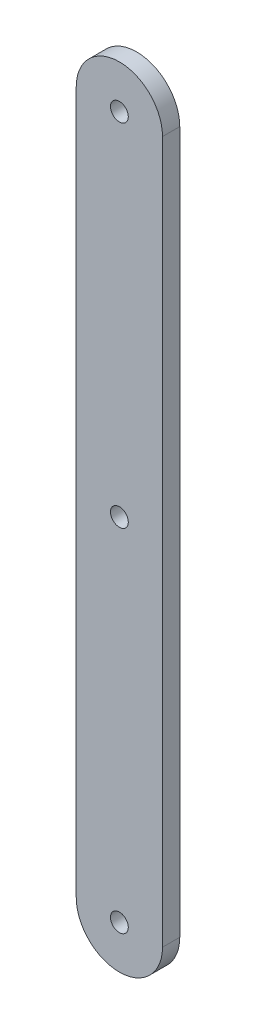
ISO-10303-21;
HEADER;
FILE_DESCRIPTION(('STEP AP214'),'2;1');
FILE_NAME('part.step','',(''),(''),'','','');
FILE_SCHEMA(('AUTOMOTIVE_DESIGN { 1 0 10303 214 1 1 1 1 }'));
ENDSEC;
DATA;
#1=APPLICATION_CONTEXT('core data for automotive mechanical design processes');
#2=APPLICATION_PROTOCOL_DEFINITION('international standard','automotive_design',2000,#1);
#3=PRODUCT_CONTEXT('',#1,'mechanical');
#4=PRODUCT('Part','Part','',(#3));
#5=PRODUCT_RELATED_PRODUCT_CATEGORY('part','',(#4));
#6=PRODUCT_DEFINITION_FORMATION('','',#4);
#7=PRODUCT_DEFINITION_CONTEXT('part definition',#1,'design');
#8=PRODUCT_DEFINITION('design','',#6,#7);
#9=PRODUCT_DEFINITION_SHAPE('','',#8);
#10=(LENGTH_UNIT() NAMED_UNIT(*) SI_UNIT(.MILLI.,.METRE.));
#11=(NAMED_UNIT(*) PLANE_ANGLE_UNIT() SI_UNIT($,.RADIAN.));
#12=(NAMED_UNIT(*) SI_UNIT($,.STERADIAN.) SOLID_ANGLE_UNIT());
#13=UNCERTAINTY_MEASURE_WITH_UNIT(LENGTH_MEASURE(1.E-05),#10,'distance_accuracy_value','');
#14=(GEOMETRIC_REPRESENTATION_CONTEXT(3) GLOBAL_UNCERTAINTY_ASSIGNED_CONTEXT((#13)) GLOBAL_UNIT_ASSIGNED_CONTEXT((#10,
#11,#12)) REPRESENTATION_CONTEXT('',''));
#15=CARTESIAN_POINT('',(0.,0.,0.));
#16=DIRECTION('',(0.,0.,1.));
#17=DIRECTION('',(1.,0.,0.));
#18=AXIS2_PLACEMENT_3D('',#15,#16,#17);
#19=CARTESIAN_POINT('',(0.,0.,3.));
#20=DIRECTION('',(0.,0.,1.));
#21=DIRECTION('',(1.,0.,0.));
#22=AXIS2_PLACEMENT_3D('',#19,#20,#21);
#23=PLANE('',#22);
#24=CARTESIAN_POINT('',(0.,122.06,3.));
#25=DIRECTION('',(0.,0.,1.));
#26=DIRECTION('',(1.,0.,0.));
#27=AXIS2_PLACEMENT_3D('',#24,#25,#26);
#28=CIRCLE('',#27,1.55);
#29=CARTESIAN_POINT('',(1.54999999999998,122.06,3.));
#30=VERTEX_POINT('',#29);
#31=EDGE_CURVE('E114',#30,#30,#28,.T.);
#32=ORIENTED_EDGE('',*,*,#31,.F.);
#33=EDGE_LOOP('',(#32));
#34=FACE_BOUND('',#33,.T.);
#35=CARTESIAN_POINT('',(0.,0.,3.));
#36=DIRECTION('',(0.,0.,1.));
#37=DIRECTION('',(1.,0.,0.));
#38=AXIS2_PLACEMENT_3D('',#35,#36,#37);
#39=CIRCLE('',#38,7.5);
#40=CARTESIAN_POINT('',(-7.5,0.,3.));
#41=VERTEX_POINT('',#40);
#42=CARTESIAN_POINT('',(7.5,0.,3.));
#43=VERTEX_POINT('',#42);
#44=EDGE_CURVE('E84',#41,#43,#39,.T.);
#45=ORIENTED_EDGE('',*,*,#44,.T.);
#46=DIRECTION('',(0.,1.,0.));
#47=VECTOR('',#46,1.);
#48=CARTESIAN_POINT('',(7.5,0.,3.));
#49=LINE('',#48,#47);
#50=CARTESIAN_POINT('',(7.49999999999998,122.06,3.));
#51=VERTEX_POINT('',#50);
#52=EDGE_CURVE('E79',#43,#51,#49,.T.);
#53=ORIENTED_EDGE('',*,*,#52,.T.);
#54=CARTESIAN_POINT('',(0.,122.06,3.));
#55=DIRECTION('',(0.,0.,1.));
#56=DIRECTION('',(1.,0.,0.));
#57=AXIS2_PLACEMENT_3D('',#54,#55,#56);
#58=CIRCLE('',#57,7.5);
#59=CARTESIAN_POINT('',(-7.50000000000002,122.06,3.));
#60=VERTEX_POINT('',#59);
#61=EDGE_CURVE('E82',#51,#60,#58,.T.);
#62=ORIENTED_EDGE('',*,*,#61,.T.);
#63=DIRECTION('',(0.,-1.,0.));
#64=VECTOR('',#63,1.);
#65=CARTESIAN_POINT('',(-7.5,0.,3.));
#66=LINE('',#65,#64);
#67=EDGE_CURVE('E49',#60,#41,#66,.T.);
#68=ORIENTED_EDGE('',*,*,#67,.T.);
#69=EDGE_LOOP('',(#45,#53,#62,#68));
#70=FACE_BOUND('',#69,.T.);
#71=CARTESIAN_POINT('',(0.,0.,3.));
#72=DIRECTION('',(0.,0.,1.));
#73=DIRECTION('',(1.,0.,0.));
#74=AXIS2_PLACEMENT_3D('',#71,#72,#73);
#75=CIRCLE('',#74,1.55);
#76=CARTESIAN_POINT('',(1.55,0.,3.));
#77=VERTEX_POINT('',#76);
#78=EDGE_CURVE('E99',#77,#77,#75,.T.);
#79=ORIENTED_EDGE('',*,*,#78,.F.);
#80=EDGE_LOOP('',(#79));
#81=FACE_BOUND('',#80,.T.);
#82=CARTESIAN_POINT('',(0.,61.03,3.));
#83=DIRECTION('',(0.,0.,1.));
#84=DIRECTION('',(1.,0.,0.));
#85=AXIS2_PLACEMENT_3D('',#82,#83,#84);
#86=CIRCLE('',#85,1.55);
#87=CARTESIAN_POINT('',(1.55,61.03,3.));
#88=VERTEX_POINT('',#87);
#89=EDGE_CURVE('E120',#88,#88,#86,.T.);
#90=ORIENTED_EDGE('',*,*,#89,.F.);
#91=EDGE_LOOP('',(#90));
#92=FACE_BOUND('',#91,.T.);
#93=ADVANCED_FACE('F32',(#34,#70,#81,#92),#23,.T.);
#94=CARTESIAN_POINT('',(0.,0.,0.));
#95=DIRECTION('',(0.,0.,1.));
#96=DIRECTION('',(1.,0.,0.));
#97=AXIS2_PLACEMENT_3D('',#94,#95,#96);
#98=PLANE('',#97);
#99=CARTESIAN_POINT('',(0.,0.,0.));
#100=DIRECTION('',(0.,0.,1.));
#101=DIRECTION('',(1.,0.,0.));
#102=AXIS2_PLACEMENT_3D('',#99,#100,#101);
#103=CIRCLE('',#102,7.5);
#104=CARTESIAN_POINT('',(-7.5,0.,0.));
#105=VERTEX_POINT('',#104);
#106=CARTESIAN_POINT('',(7.5,0.,0.));
#107=VERTEX_POINT('',#106);
#108=EDGE_CURVE('E96',#105,#107,#103,.T.);
#109=ORIENTED_EDGE('',*,*,#108,.F.);
#110=DIRECTION('',(0.,-1.,0.));
#111=VECTOR('',#110,1.);
#112=CARTESIAN_POINT('',(-7.5,0.,0.));
#113=LINE('',#112,#111);
#114=CARTESIAN_POINT('',(-7.50000000000002,122.06,0.));
#115=VERTEX_POINT('',#114);
#116=EDGE_CURVE('E72',#115,#105,#113,.T.);
#117=ORIENTED_EDGE('',*,*,#116,.F.);
#118=CARTESIAN_POINT('',(0.,122.06,0.));
#119=DIRECTION('',(0.,0.,1.));
#120=DIRECTION('',(1.,0.,0.));
#121=AXIS2_PLACEMENT_3D('',#118,#119,#120);
#122=CIRCLE('',#121,7.5);
#123=CARTESIAN_POINT('',(7.49999999999998,122.06,0.));
#124=VERTEX_POINT('',#123);
#125=EDGE_CURVE('E66',#124,#115,#122,.T.);
#126=ORIENTED_EDGE('',*,*,#125,.F.);
#127=DIRECTION('',(0.,1.,0.));
#128=VECTOR('',#127,1.);
#129=CARTESIAN_POINT('',(7.5,0.,0.));
#130=LINE('',#129,#128);
#131=EDGE_CURVE('E88',#107,#124,#130,.T.);
#132=ORIENTED_EDGE('',*,*,#131,.F.);
#133=EDGE_LOOP('',(#109,#117,#126,#132));
#134=FACE_BOUND('',#133,.T.);
#135=CARTESIAN_POINT('',(0.,0.,0.));
#136=DIRECTION('',(0.,0.,1.));
#137=DIRECTION('',(1.,0.,0.));
#138=AXIS2_PLACEMENT_3D('',#135,#136,#137);
#139=CIRCLE('',#138,1.55);
#140=CARTESIAN_POINT('',(1.55,0.,0.));
#141=VERTEX_POINT('',#140);
#142=EDGE_CURVE('E111',#141,#141,#139,.T.);
#143=ORIENTED_EDGE('',*,*,#142,.T.);
#144=EDGE_LOOP('',(#143));
#145=FACE_BOUND('',#144,.T.);
#146=CARTESIAN_POINT('',(0.,122.06,0.));
#147=DIRECTION('',(0.,0.,1.));
#148=DIRECTION('',(1.,0.,0.));
#149=AXIS2_PLACEMENT_3D('',#146,#147,#148);
#150=CIRCLE('',#149,1.55);
#151=CARTESIAN_POINT('',(1.54999999999998,122.06,0.));
#152=VERTEX_POINT('',#151);
#153=EDGE_CURVE('E117',#152,#152,#150,.T.);
#154=ORIENTED_EDGE('',*,*,#153,.T.);
#155=EDGE_LOOP('',(#154));
#156=FACE_BOUND('',#155,.T.);
#157=CARTESIAN_POINT('',(0.,61.03,0.));
#158=DIRECTION('',(0.,0.,1.));
#159=DIRECTION('',(1.,0.,0.));
#160=AXIS2_PLACEMENT_3D('',#157,#158,#159);
#161=CIRCLE('',#160,1.55);
#162=CARTESIAN_POINT('',(1.55,61.03,0.));
#163=VERTEX_POINT('',#162);
#164=EDGE_CURVE('E123',#163,#163,#161,.T.);
#165=ORIENTED_EDGE('',*,*,#164,.T.);
#166=EDGE_LOOP('',(#165));
#167=FACE_BOUND('',#166,.T.);
#168=ADVANCED_FACE('F107',(#134,#145,#156,#167),#98,.F.);
#169=CARTESIAN_POINT('',(0.,0.,3.));
#170=DIRECTION('',(0.,0.,-1.));
#171=DIRECTION('',(-1.,0.,0.));
#172=AXIS2_PLACEMENT_3D('',#169,#170,#171);
#173=CYLINDRICAL_SURFACE('',#172,7.5);
#174=ORIENTED_EDGE('',*,*,#108,.T.);
#175=DIRECTION('',(0.,0.,-1.));
#176=VECTOR('',#175,1.);
#177=CARTESIAN_POINT('',(7.5,0.,3.));
#178=LINE('',#177,#176);
#179=EDGE_CURVE('E11',#43,#107,#178,.T.);
#180=ORIENTED_EDGE('',*,*,#179,.F.);
#181=ORIENTED_EDGE('',*,*,#44,.F.);
#182=DIRECTION('',(0.,0.,-1.));
#183=VECTOR('',#182,1.);
#184=CARTESIAN_POINT('',(-7.5,0.,3.));
#185=LINE('',#184,#183);
#186=EDGE_CURVE('E92',#41,#105,#185,.T.);
#187=ORIENTED_EDGE('',*,*,#186,.T.);
#188=EDGE_LOOP('',(#174,#180,#181,#187));
#189=FACE_BOUND('',#188,.T.);
#190=ADVANCED_FACE('F34',(#189),#173,.T.);
#191=CARTESIAN_POINT('',(7.5,0.,3.));
#192=DIRECTION('',(-1.,0.,0.));
#193=DIRECTION('',(0.,-1.,0.));
#194=AXIS2_PLACEMENT_3D('',#191,#192,#193);
#195=PLANE('',#194);
#196=ORIENTED_EDGE('',*,*,#131,.T.);
#197=DIRECTION('',(0.,0.,-1.));
#198=VECTOR('',#197,1.);
#199=CARTESIAN_POINT('',(7.49999999999998,122.06,3.));
#200=LINE('',#199,#198);
#201=EDGE_CURVE('E41',#51,#124,#200,.T.);
#202=ORIENTED_EDGE('',*,*,#201,.F.);
#203=ORIENTED_EDGE('',*,*,#52,.F.);
#204=ORIENTED_EDGE('',*,*,#179,.T.);
#205=EDGE_LOOP('',(#196,#202,#203,#204));
#206=FACE_BOUND('',#205,.T.);
#207=ADVANCED_FACE('F87',(#206),#195,.F.);
#208=CARTESIAN_POINT('',(0.,122.06,3.));
#209=DIRECTION('',(0.,0.,-1.));
#210=DIRECTION('',(-1.,0.,0.));
#211=AXIS2_PLACEMENT_3D('',#208,#209,#210);
#212=CYLINDRICAL_SURFACE('',#211,7.5);
#213=ORIENTED_EDGE('',*,*,#125,.T.);
#214=DIRECTION('',(0.,0.,-1.));
#215=VECTOR('',#214,1.);
#216=CARTESIAN_POINT('',(-7.50000000000002,122.06,3.));
#217=LINE('',#216,#215);
#218=EDGE_CURVE('E89',#60,#115,#217,.T.);
#219=ORIENTED_EDGE('',*,*,#218,.F.);
#220=ORIENTED_EDGE('',*,*,#61,.F.);
#221=ORIENTED_EDGE('',*,*,#201,.T.);
#222=EDGE_LOOP('',(#213,#219,#220,#221));
#223=FACE_BOUND('',#222,.T.);
#224=ADVANCED_FACE('F90',(#223),#212,.T.);
#225=CARTESIAN_POINT('',(-7.5,0.,3.));
#226=DIRECTION('',(1.,0.,0.));
#227=DIRECTION('',(0.,1.,0.));
#228=AXIS2_PLACEMENT_3D('',#225,#226,#227);
#229=PLANE('',#228);
#230=ORIENTED_EDGE('',*,*,#116,.T.);
#231=ORIENTED_EDGE('',*,*,#186,.F.);
#232=ORIENTED_EDGE('',*,*,#67,.F.);
#233=ORIENTED_EDGE('',*,*,#218,.T.);
#234=EDGE_LOOP('',(#230,#231,#232,#233));
#235=FACE_BOUND('',#234,.T.);
#236=ADVANCED_FACE('F104',(#235),#229,.F.);
#237=CARTESIAN_POINT('',(0.,0.,3.));
#238=DIRECTION('',(0.,0.,-1.));
#239=DIRECTION('',(-1.,0.,0.));
#240=AXIS2_PLACEMENT_3D('',#237,#238,#239);
#241=CYLINDRICAL_SURFACE('',#240,1.55);
#242=ORIENTED_EDGE('',*,*,#78,.T.);
#243=EDGE_LOOP('',(#242));
#244=FACE_BOUND('',#243,.T.);
#245=ORIENTED_EDGE('',*,*,#142,.F.);
#246=EDGE_LOOP('',(#245));
#247=FACE_BOUND('',#246,.T.);
#248=ADVANCED_FACE('F141',(#244,#247),#241,.F.);
#249=CARTESIAN_POINT('',(0.,122.06,3.));
#250=DIRECTION('',(0.,0.,-1.));
#251=DIRECTION('',(-1.,0.,0.));
#252=AXIS2_PLACEMENT_3D('',#249,#250,#251);
#253=CYLINDRICAL_SURFACE('',#252,1.55);
#254=ORIENTED_EDGE('',*,*,#31,.T.);
#255=EDGE_LOOP('',(#254));
#256=FACE_BOUND('',#255,.T.);
#257=ORIENTED_EDGE('',*,*,#153,.F.);
#258=EDGE_LOOP('',(#257));
#259=FACE_BOUND('',#258,.T.);
#260=ADVANCED_FACE('F187',(#256,#259),#253,.F.);
#261=CARTESIAN_POINT('',(0.,61.03,3.));
#262=DIRECTION('',(0.,0.,-1.));
#263=DIRECTION('',(-1.,0.,0.));
#264=AXIS2_PLACEMENT_3D('',#261,#262,#263);
#265=CYLINDRICAL_SURFACE('',#264,1.55);
#266=ORIENTED_EDGE('',*,*,#89,.T.);
#267=EDGE_LOOP('',(#266));
#268=FACE_BOUND('',#267,.T.);
#269=ORIENTED_EDGE('',*,*,#164,.F.);
#270=EDGE_LOOP('',(#269));
#271=FACE_BOUND('',#270,.T.);
#272=ADVANCED_FACE('F129',(#268,#271),#265,.F.);
#273=CLOSED_SHELL('',(#93,#168,#190,#207,#224,#236,#248,#260,#272));
#274=MANIFOLD_SOLID_BREP('B2',#273);
#275=ADVANCED_BREP_SHAPE_REPRESENTATION('',(#18,#274),#14);
#276=SHAPE_DEFINITION_REPRESENTATION(#9,#275);
ENDSEC;
END-ISO-10303-21;
